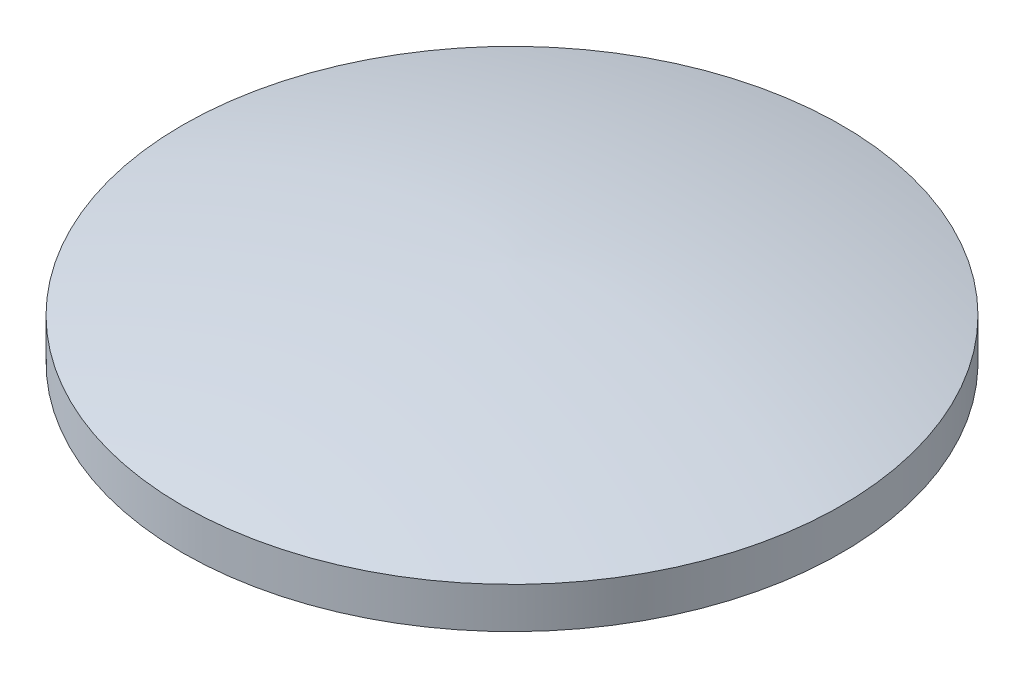
ISO-10303-21;
HEADER;
FILE_DESCRIPTION(('STEP AP214'),'2;1');
FILE_NAME('part.step','',(''),(''),'','','');
FILE_SCHEMA(('AUTOMOTIVE_DESIGN { 1 0 10303 214 1 1 1 1 }'));
ENDSEC;
DATA;
#1=APPLICATION_CONTEXT('core data for automotive mechanical design processes');
#2=APPLICATION_PROTOCOL_DEFINITION('international standard','automotive_design',2000,#1);
#3=PRODUCT_CONTEXT('',#1,'mechanical');
#4=PRODUCT('Part','Part','',(#3));
#5=PRODUCT_RELATED_PRODUCT_CATEGORY('part','',(#4));
#6=PRODUCT_DEFINITION_FORMATION('','',#4);
#7=PRODUCT_DEFINITION_CONTEXT('part definition',#1,'design');
#8=PRODUCT_DEFINITION('design','',#6,#7);
#9=PRODUCT_DEFINITION_SHAPE('','',#8);
#10=(LENGTH_UNIT() NAMED_UNIT(*) SI_UNIT(.MILLI.,.METRE.));
#11=(NAMED_UNIT(*) PLANE_ANGLE_UNIT() SI_UNIT($,.RADIAN.));
#12=(NAMED_UNIT(*) SI_UNIT($,.STERADIAN.) SOLID_ANGLE_UNIT());
#13=UNCERTAINTY_MEASURE_WITH_UNIT(LENGTH_MEASURE(1.E-05),#10,'distance_accuracy_value','');
#14=(GEOMETRIC_REPRESENTATION_CONTEXT(3) GLOBAL_UNCERTAINTY_ASSIGNED_CONTEXT((#13)) GLOBAL_UNIT_ASSIGNED_CONTEXT((#10,
#11,#12)) REPRESENTATION_CONTEXT('',''));
#15=CARTESIAN_POINT('',(0.,0.,0.));
#16=DIRECTION('',(0.,0.,1.));
#17=DIRECTION('',(1.,0.,0.));
#18=AXIS2_PLACEMENT_3D('',#15,#16,#17);
#19=CARTESIAN_POINT('',(0.,4.80703832189669,0.));
#20=DIRECTION('',(0.,-1.,0.));
#21=DIRECTION('',(0.,0.,-1.));
#22=AXIS2_PLACEMENT_3D('',#19,#20,#21);
#23=PLANE('',#22);
#24=CARTESIAN_POINT('',(8.055,4.80703832189669,0.));
#25=DIRECTION('',(0.,1.,0.));
#26=DIRECTION('',(0.,0.,1.));
#27=AXIS2_PLACEMENT_3D('',#24,#25,#26);
#28=CIRCLE('',#27,8.055);
#29=CARTESIAN_POINT('',(8.055,4.80703832189669,8.055));
#30=VERTEX_POINT('',#29);
#31=EDGE_CURVE('E39',#30,#30,#28,.T.);
#32=ORIENTED_EDGE('',*,*,#31,.F.);
#33=EDGE_LOOP('',(#32));
#34=FACE_BOUND('',#33,.T.);
#35=ADVANCED_FACE('F33',(#34),#23,.T.);
#36=CARTESIAN_POINT('',(8.055,6.98868355173587,0.));
#37=CARTESIAN_POINT('',(3.93201992815037,6.89692989135373,0.));
#38=CARTESIAN_POINT('',(0.,5.80703832189669,0.));
#39=B_SPLINE_CURVE_WITH_KNOTS('',2,(#36,#37,#38),.UNSPECIFIED.,.F.,.F.,(3,3),(0.,1.),.UNSPECIFIED.);
#40=CARTESIAN_POINT('',(8.055,6.98868355173587,0.));
#41=DIRECTION('',(0.,1.,0.));
#42=AXIS1_PLACEMENT('',#40,#41);
#43=SURFACE_OF_REVOLUTION('',#39,#42);
#44=CARTESIAN_POINT('',(8.055,5.80703832189669,0.));
#45=DIRECTION('',(0.,1.,0.));
#46=DIRECTION('',(0.,0.,1.));
#47=AXIS2_PLACEMENT_3D('',#44,#45,#46);
#48=CIRCLE('',#47,8.055);
#49=CARTESIAN_POINT('',(8.055,5.80703832189669,8.055));
#50=VERTEX_POINT('',#49);
#51=EDGE_CURVE('E11',#50,#50,#48,.T.);
#52=ORIENTED_EDGE('',*,*,#51,.T.);
#53=EDGE_LOOP('',(#52));
#54=FACE_BOUND('',#53,.T.);
#55=CARTESIAN_POINT('',(8.055,6.98868355173587,0.));
#56=VERTEX_POINT('',#55);
#57=VERTEX_LOOP('',#56);
#58=FACE_BOUND('',#57,.T.);
#59=ADVANCED_FACE('F42',(#54,#58),#43,.F.);
#60=CARTESIAN_POINT('',(8.055,6.98868355173587,0.));
#61=DIRECTION('',(0.,1.,0.));
#62=DIRECTION('',(0.,0.,1.));
#63=AXIS2_PLACEMENT_3D('',#60,#61,#62);
#64=CYLINDRICAL_SURFACE('',#63,8.055);
#65=ORIENTED_EDGE('',*,*,#31,.T.);
#66=EDGE_LOOP('',(#65));
#67=FACE_BOUND('',#66,.T.);
#68=ORIENTED_EDGE('',*,*,#51,.F.);
#69=EDGE_LOOP('',(#68));
#70=FACE_BOUND('',#69,.T.);
#71=ADVANCED_FACE('F44',(#67,#70),#64,.T.);
#72=CLOSED_SHELL('',(#35,#59,#71));
#73=MANIFOLD_SOLID_BREP('B2',#72);
#74=ADVANCED_BREP_SHAPE_REPRESENTATION('',(#18,#73),#14);
#75=SHAPE_DEFINITION_REPRESENTATION(#9,#74);
ENDSEC;
END-ISO-10303-21;
